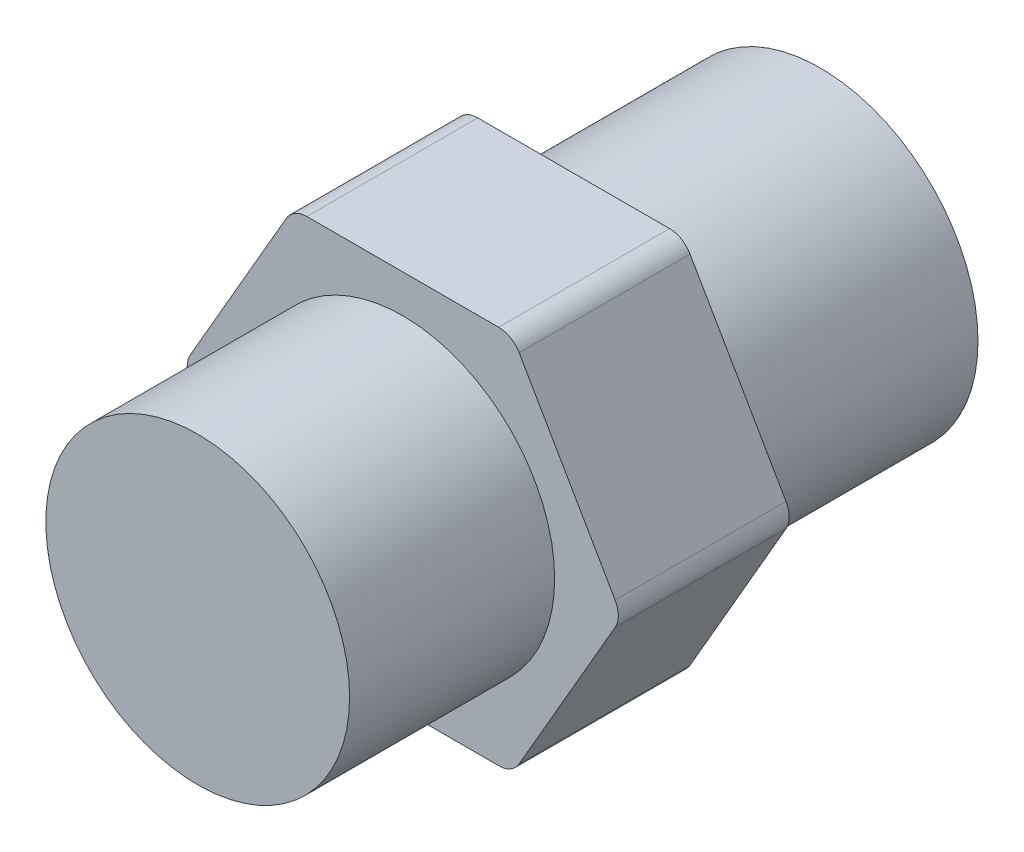
ISO-10303-21;
HEADER;
FILE_DESCRIPTION(('STEP AP214'),'2;1');
FILE_NAME('part.step','',(''),(''),'','','');
FILE_SCHEMA(('AUTOMOTIVE_DESIGN { 1 0 10303 214 1 1 1 1 }'));
ENDSEC;
DATA;
#1=APPLICATION_CONTEXT('core data for automotive mechanical design processes');
#2=APPLICATION_PROTOCOL_DEFINITION('international standard','automotive_design',2000,#1);
#3=PRODUCT_CONTEXT('',#1,'mechanical');
#4=PRODUCT('Part','Part','',(#3));
#5=PRODUCT_RELATED_PRODUCT_CATEGORY('part','',(#4));
#6=PRODUCT_DEFINITION_FORMATION('','',#4);
#7=PRODUCT_DEFINITION_CONTEXT('part definition',#1,'design');
#8=PRODUCT_DEFINITION('design','',#6,#7);
#9=PRODUCT_DEFINITION_SHAPE('','',#8);
#10=(LENGTH_UNIT() NAMED_UNIT(*) SI_UNIT(.MILLI.,.METRE.));
#11=(NAMED_UNIT(*) PLANE_ANGLE_UNIT() SI_UNIT($,.RADIAN.));
#12=(NAMED_UNIT(*) SI_UNIT($,.STERADIAN.) SOLID_ANGLE_UNIT());
#13=UNCERTAINTY_MEASURE_WITH_UNIT(LENGTH_MEASURE(1.E-05),#10,'distance_accuracy_value','');
#14=(GEOMETRIC_REPRESENTATION_CONTEXT(3) GLOBAL_UNCERTAINTY_ASSIGNED_CONTEXT((#13)) GLOBAL_UNIT_ASSIGNED_CONTEXT((#10,
#11,#12)) REPRESENTATION_CONTEXT('',''));
#15=CARTESIAN_POINT('',(0.,0.,0.));
#16=DIRECTION('',(0.,0.,1.));
#17=DIRECTION('',(1.,0.,0.));
#18=AXIS2_PLACEMENT_3D('',#15,#16,#17);
#19=CARTESIAN_POINT('',(-14.6646968374165,0.,11.43));
#20=DIRECTION('',(0.866025403784439,0.5,0.));
#21=DIRECTION('',(-0.5,0.866025403784439,0.));
#22=AXIS2_PLACEMENT_3D('',#19,#20,#21);
#23=PLANE('',#22);
#24=DIRECTION('',(0.5,-0.866025403784438,0.));
#25=VECTOR('',#24,1.);
#26=CARTESIAN_POINT('',(-14.6646968374165,0.,11.43));
#27=LINE('',#26,#25);
#28=CARTESIAN_POINT('',(-14.2064250612472,-0.793749999999992,11.43));
#29=VERTEX_POINT('',#28);
#30=CARTESIAN_POINT('',(-7.79062019487751,-11.90625,11.43));
#31=VERTEX_POINT('',#30);
#32=EDGE_CURVE('E229',#29,#31,#27,.T.);
#33=ORIENTED_EDGE('',*,*,#32,.F.);
#34=DIRECTION('',(0.,0.,-1.));
#35=VECTOR('',#34,1.);
#36=CARTESIAN_POINT('',(-14.2064250612472,-0.793749999999992,11.43));
#37=LINE('',#36,#35);
#38=CARTESIAN_POINT('',(-14.2064250612472,-0.793749999999992,0.));
#39=VERTEX_POINT('',#38);
#40=EDGE_CURVE('E214',#29,#39,#37,.T.);
#41=ORIENTED_EDGE('',*,*,#40,.T.);
#42=DIRECTION('',(0.5,-0.866025403784438,0.));
#43=VECTOR('',#42,1.);
#44=CARTESIAN_POINT('',(-14.6646968374165,0.,0.));
#45=LINE('',#44,#43);
#46=CARTESIAN_POINT('',(-7.79062019487751,-11.90625,0.));
#47=VERTEX_POINT('',#46);
#48=EDGE_CURVE('E226',#39,#47,#45,.T.);
#49=ORIENTED_EDGE('',*,*,#48,.T.);
#50=DIRECTION('',(0.,0.,-1.));
#51=VECTOR('',#50,1.);
#52=CARTESIAN_POINT('',(-7.79062019487751,-11.90625,11.43));
#53=LINE('',#52,#51);
#54=EDGE_CURVE('E231',#47,#31,#53,.F.);
#55=ORIENTED_EDGE('',*,*,#54,.T.);
#56=EDGE_LOOP('',(#33,#41,#49,#55));
#57=FACE_BOUND('',#56,.T.);
#58=DIRECTION('',(0.25,-0.433012701892219,0.866025403784439));
#59=VECTOR('',#58,1.);
#60=CARTESIAN_POINT('',(-10.1461371243875,-7.82637499999999,-0.984249999999998));
#61=LINE('',#60,#59);
#62=CARTESIAN_POINT('',(-9.37624054042317,-9.15987499999999,1.68275));
#63=VERTEX_POINT('',#62);
#64=CARTESIAN_POINT('',(-8.44136611703786,-10.779125,4.92125));
#65=VERTEX_POINT('',#64);
#66=EDGE_CURVE('E374',#63,#65,#61,.T.);
#67=ORIENTED_EDGE('',*,*,#66,.F.);
#68=CARTESIAN_POINT('',(-10.0636482046771,-7.96924999999999,2.4765));
#69=DIRECTION('',(0.866025403784439,0.5,0.));
#70=DIRECTION('',(-0.5,0.866025403784439,0.));
#71=AXIS2_PLACEMENT_3D('',#68,#69,#70);
#72=CIRCLE('',#71,1.5875);
#73=CARTESIAN_POINT('',(-10.0636482046771,-7.96924999999999,0.888999999999997));
#74=VERTEX_POINT('',#73);
#75=EDGE_CURVE('E333',#63,#74,#72,.T.);
#76=ORIENTED_EDGE('',*,*,#75,.T.);
#77=DIRECTION('',(0.5,-0.866025403784439,0.));
#78=VECTOR('',#77,1.);
#79=CARTESIAN_POINT('',(-10.9985226280624,-6.35,0.888999999999997));
#80=LINE('',#79,#78);
#81=CARTESIAN_POINT('',(-11.9333970514477,-4.73074999999999,0.888999999999997));
#82=VERTEX_POINT('',#81);
#83=EDGE_CURVE('E384',#82,#74,#80,.T.);
#84=ORIENTED_EDGE('',*,*,#83,.F.);
#85=CARTESIAN_POINT('',(-11.9333970514477,-4.73074999999999,2.4765));
#86=DIRECTION('',(0.866025403784439,0.5,0.));
#87=DIRECTION('',(-0.5,0.866025403784439,0.));
#88=AXIS2_PLACEMENT_3D('',#85,#86,#87);
#89=CIRCLE('',#88,1.5875);
#90=CARTESIAN_POINT('',(-12.6208047157016,-3.54012499999999,1.68275));
#91=VERTEX_POINT('',#90);
#92=EDGE_CURVE('E331',#82,#91,#89,.T.);
#93=ORIENTED_EDGE('',*,*,#92,.T.);
#94=DIRECTION('',(0.25,-0.433012701892219,-0.866025403784438));
#95=VECTOR('',#94,1.);
#96=CARTESIAN_POINT('',(-11.8509081317372,-4.87362499999999,-0.984250000000006));
#97=LINE('',#96,#95);
#98=CARTESIAN_POINT('',(-13.5556791390869,-1.92087499999999,4.92125));
#99=VERTEX_POINT('',#98);
#100=EDGE_CURVE('E381',#99,#91,#97,.T.);
#101=ORIENTED_EDGE('',*,*,#100,.F.);
#102=CARTESIAN_POINT('',(-12.868271474833,-3.11149999999999,5.715));
#103=DIRECTION('',(0.866025403784439,0.5,0.));
#104=DIRECTION('',(-0.5,0.866025403784439,0.));
#105=AXIS2_PLACEMENT_3D('',#102,#103,#104);
#106=CIRCLE('',#105,1.5875);
#107=CARTESIAN_POINT('',(-13.5556791390869,-1.92087499999999,6.50875));
#108=VERTEX_POINT('',#107);
#109=EDGE_CURVE('E13',#99,#108,#106,.T.);
#110=ORIENTED_EDGE('',*,*,#109,.T.);
#111=DIRECTION('',(-0.25,0.433012701892219,-0.866025403784439));
#112=VECTOR('',#111,1.);
#113=CARTESIAN_POINT('',(-14.3255757230512,-0.587374999999987,3.84175000000001));
#114=LINE('',#113,#112);
#115=CARTESIAN_POINT('',(-12.6208047157016,-3.54012499999999,9.74725));
#116=VERTEX_POINT('',#115);
#117=EDGE_CURVE('E342',#116,#108,#114,.T.);
#118=ORIENTED_EDGE('',*,*,#117,.F.);
#119=CARTESIAN_POINT('',(-11.9333970514477,-4.73074999999999,8.9535));
#120=DIRECTION('',(0.866025403784439,0.5,0.));
#121=DIRECTION('',(-0.5,0.866025403784439,0.));
#122=AXIS2_PLACEMENT_3D('',#119,#120,#121);
#123=CIRCLE('',#122,1.5875);
#124=CARTESIAN_POINT('',(-11.9333970514477,-4.73074999999999,10.541));
#125=VERTEX_POINT('',#124);
#126=EDGE_CURVE('E58',#116,#125,#123,.T.);
#127=ORIENTED_EDGE('',*,*,#126,.T.);
#128=DIRECTION('',(-0.5,0.866025403784439,0.));
#129=VECTOR('',#128,1.);
#130=CARTESIAN_POINT('',(-10.9985226280624,-6.35,10.541));
#131=LINE('',#130,#129);
#132=CARTESIAN_POINT('',(-10.0636482046771,-7.96924999999999,10.541));
#133=VERTEX_POINT('',#132);
#134=EDGE_CURVE('E341',#133,#125,#131,.T.);
#135=ORIENTED_EDGE('',*,*,#134,.F.);
#136=CARTESIAN_POINT('',(-10.0636482046771,-7.96924999999999,8.9535));
#137=DIRECTION('',(0.866025403784439,0.5,0.));
#138=DIRECTION('',(-0.5,0.866025403784439,0.));
#139=AXIS2_PLACEMENT_3D('',#136,#137,#138);
#140=CIRCLE('',#139,1.5875);
#141=CARTESIAN_POINT('',(-9.37624054042317,-9.15987499999999,9.74725));
#142=VERTEX_POINT('',#141);
#143=EDGE_CURVE('E337',#133,#142,#140,.T.);
#144=ORIENTED_EDGE('',*,*,#143,.T.);
#145=DIRECTION('',(-0.25,0.433012701892219,0.866025403784439));
#146=VECTOR('',#145,1.);
#147=CARTESIAN_POINT('',(-7.6714695330735,-12.112625,3.84175));
#148=LINE('',#147,#146);
#149=CARTESIAN_POINT('',(-8.44136611703787,-10.779125,6.50875));
#150=VERTEX_POINT('',#149);
#151=EDGE_CURVE('E348',#150,#142,#148,.T.);
#152=ORIENTED_EDGE('',*,*,#151,.F.);
#153=CARTESIAN_POINT('',(-9.12877378129177,-9.58849999999999,5.715));
#154=DIRECTION('',(0.866025403784439,0.5,0.));
#155=DIRECTION('',(-0.5,0.866025403784439,0.));
#156=AXIS2_PLACEMENT_3D('',#153,#154,#155);
#157=CIRCLE('',#156,1.5875);
#158=EDGE_CURVE('E335',#150,#65,#157,.T.);
#159=ORIENTED_EDGE('',*,*,#158,.T.);
#160=EDGE_LOOP('',(#67,#76,#84,#93,#101,#110,#118,#127,#135,#144,#152,#159));
#161=FACE_BOUND('',#160,.T.);
#162=ADVANCED_FACE('F50',(#57,#161),#23,.F.);
#163=CARTESIAN_POINT('',(7.33234841870828,-12.7,11.43));
#164=DIRECTION('',(-0.866025403784439,0.5,0.));
#165=DIRECTION('',(-0.5,-0.866025403784439,0.));
#166=AXIS2_PLACEMENT_3D('',#163,#164,#165);
#167=PLANE('',#166);
#168=DIRECTION('',(0.5,0.866025403784439,0.));
#169=VECTOR('',#168,1.);
#170=CARTESIAN_POINT('',(7.33234841870828,-12.7,0.));
#171=LINE('',#170,#169);
#172=CARTESIAN_POINT('',(7.79062019487755,-11.90625,0.));
#173=VERTEX_POINT('',#172);
#174=CARTESIAN_POINT('',(14.2064250612472,-0.793750000000037,0.));
#175=VERTEX_POINT('',#174);
#176=EDGE_CURVE('E373',#173,#175,#171,.T.);
#177=ORIENTED_EDGE('',*,*,#176,.T.);
#178=DIRECTION('',(0.,0.,-1.));
#179=VECTOR('',#178,1.);
#180=CARTESIAN_POINT('',(14.2064250612472,-0.793750000000032,11.43));
#181=LINE('',#180,#179);
#182=CARTESIAN_POINT('',(14.2064250612472,-0.793750000000037,11.43));
#183=VERTEX_POINT('',#182);
#184=EDGE_CURVE('E283',#175,#183,#181,.F.);
#185=ORIENTED_EDGE('',*,*,#184,.T.);
#186=DIRECTION('',(0.5,0.866025403784439,0.));
#187=VECTOR('',#186,1.);
#188=CARTESIAN_POINT('',(7.33234841870828,-12.7,11.43));
#189=LINE('',#188,#187);
#190=CARTESIAN_POINT('',(7.79062019487755,-11.90625,11.43));
#191=VERTEX_POINT('',#190);
#192=EDGE_CURVE('E240',#191,#183,#189,.T.);
#193=ORIENTED_EDGE('',*,*,#192,.F.);
#194=DIRECTION('',(0.,0.,-1.));
#195=VECTOR('',#194,1.);
#196=CARTESIAN_POINT('',(7.79062019487755,-11.90625,11.43));
#197=LINE('',#196,#195);
#198=EDGE_CURVE('E280',#191,#173,#197,.T.);
#199=ORIENTED_EDGE('',*,*,#198,.T.);
#200=EDGE_LOOP('',(#177,#185,#193,#199));
#201=FACE_BOUND('',#200,.T.);
#202=ADVANCED_FACE('F437',(#201),#167,.F.);
#203=CARTESIAN_POINT('',(14.6646968374165,0.,11.43));
#204=DIRECTION('',(-0.866025403784439,-0.5,0.));
#205=DIRECTION('',(0.5,-0.866025403784439,0.));
#206=AXIS2_PLACEMENT_3D('',#203,#204,#205);
#207=PLANE('',#206);
#208=DIRECTION('',(-0.5,0.866025403784439,0.));
#209=VECTOR('',#208,1.);
#210=CARTESIAN_POINT('',(14.6646968374165,0.,0.));
#211=LINE('',#210,#209);
#212=CARTESIAN_POINT('',(14.2064250612472,0.793749999999965,0.));
#213=VERTEX_POINT('',#212);
#214=CARTESIAN_POINT('',(7.79062019487749,11.90625,0.));
#215=VERTEX_POINT('',#214);
#216=EDGE_CURVE('E406',#213,#215,#211,.T.);
#217=ORIENTED_EDGE('',*,*,#216,.T.);
#218=DIRECTION('',(0.,0.,-1.));
#219=VECTOR('',#218,1.);
#220=CARTESIAN_POINT('',(7.79062019487749,11.90625,11.43));
#221=LINE('',#220,#219);
#222=CARTESIAN_POINT('',(7.79062019487749,11.90625,11.43));
#223=VERTEX_POINT('',#222);
#224=EDGE_CURVE('E278',#215,#223,#221,.F.);
#225=ORIENTED_EDGE('',*,*,#224,.T.);
#226=DIRECTION('',(-0.5,0.866025403784439,0.));
#227=VECTOR('',#226,1.);
#228=CARTESIAN_POINT('',(14.6646968374165,0.,11.43));
#229=LINE('',#228,#227);
#230=CARTESIAN_POINT('',(14.2064250612472,0.793749999999965,11.43));
#231=VERTEX_POINT('',#230);
#232=EDGE_CURVE('E390',#231,#223,#229,.T.);
#233=ORIENTED_EDGE('',*,*,#232,.F.);
#234=DIRECTION('',(0.,0.,-1.));
#235=VECTOR('',#234,1.);
#236=CARTESIAN_POINT('',(14.2064250612472,0.793749999999965,11.43));
#237=LINE('',#236,#235);
#238=EDGE_CURVE('E275',#231,#213,#237,.T.);
#239=ORIENTED_EDGE('',*,*,#238,.T.);
#240=EDGE_LOOP('',(#217,#225,#233,#239));
#241=FACE_BOUND('',#240,.T.);
#242=ADVANCED_FACE('F433',(#241),#207,.F.);
#243=CARTESIAN_POINT('',(7.33234841870823,12.7,11.43));
#244=DIRECTION('',(0.,-1.,0.));
#245=DIRECTION('',(0.,0.,-1.));
#246=AXIS2_PLACEMENT_3D('',#243,#244,#245);
#247=PLANE('',#246);
#248=DIRECTION('',(-1.,0.,0.));
#249=VECTOR('',#248,1.);
#250=CARTESIAN_POINT('',(7.33234841870823,12.7,0.));
#251=LINE('',#250,#249);
#252=CARTESIAN_POINT('',(6.4158048663697,12.7,0.));
#253=VERTEX_POINT('',#252);
#254=CARTESIAN_POINT('',(-6.41580486636972,12.7,0.));
#255=VERTEX_POINT('',#254);
#256=EDGE_CURVE('E242',#253,#255,#251,.T.);
#257=ORIENTED_EDGE('',*,*,#256,.T.);
#258=DIRECTION('',(0.,0.,-1.));
#259=VECTOR('',#258,1.);
#260=CARTESIAN_POINT('',(-6.41580486636972,12.7,11.43));
#261=LINE('',#260,#259);
#262=CARTESIAN_POINT('',(-6.41580486636972,12.7,11.43));
#263=VERTEX_POINT('',#262);
#264=EDGE_CURVE('E273',#255,#263,#261,.F.);
#265=ORIENTED_EDGE('',*,*,#264,.T.);
#266=DIRECTION('',(-1.,0.,0.));
#267=VECTOR('',#266,1.);
#268=CARTESIAN_POINT('',(7.33234841870823,12.7,11.43));
#269=LINE('',#268,#267);
#270=CARTESIAN_POINT('',(6.4158048663697,12.7,11.43));
#271=VERTEX_POINT('',#270);
#272=EDGE_CURVE('E393',#271,#263,#269,.T.);
#273=ORIENTED_EDGE('',*,*,#272,.F.);
#274=DIRECTION('',(0.,0.,-1.));
#275=VECTOR('',#274,1.);
#276=CARTESIAN_POINT('',(6.4158048663697,12.7,11.43));
#277=LINE('',#276,#275);
#278=EDGE_CURVE('E270',#271,#253,#277,.T.);
#279=ORIENTED_EDGE('',*,*,#278,.T.);
#280=EDGE_LOOP('',(#257,#265,#273,#279));
#281=FACE_BOUND('',#280,.T.);
#282=ADVANCED_FACE('F412',(#281),#247,.F.);
#283=CARTESIAN_POINT('',(-7.33234841870825,12.7,11.43));
#284=DIRECTION('',(0.866025403784439,-0.5,0.));
#285=DIRECTION('',(0.5,0.866025403784439,0.));
#286=AXIS2_PLACEMENT_3D('',#283,#284,#285);
#287=PLANE('',#286);
#288=DIRECTION('',(-0.5,-0.866025403784438,0.));
#289=VECTOR('',#288,1.);
#290=CARTESIAN_POINT('',(-7.33234841870825,12.7,0.));
#291=LINE('',#290,#289);
#292=CARTESIAN_POINT('',(-7.79062019487751,11.90625,0.));
#293=VERTEX_POINT('',#292);
#294=CARTESIAN_POINT('',(-14.2064250612472,0.793750000000012,0.));
#295=VERTEX_POINT('',#294);
#296=EDGE_CURVE('E237',#293,#295,#291,.T.);
#297=ORIENTED_EDGE('',*,*,#296,.T.);
#298=DIRECTION('',(0.,0.,-1.));
#299=VECTOR('',#298,1.);
#300=CARTESIAN_POINT('',(-14.2064250612472,0.793750000000008,11.43));
#301=LINE('',#300,#299);
#302=CARTESIAN_POINT('',(-14.2064250612472,0.793750000000012,11.43));
#303=VERTEX_POINT('',#302);
#304=EDGE_CURVE('E215',#295,#303,#301,.F.);
#305=ORIENTED_EDGE('',*,*,#304,.T.);
#306=DIRECTION('',(-0.5,-0.866025403784438,0.));
#307=VECTOR('',#306,1.);
#308=CARTESIAN_POINT('',(-7.33234841870825,12.7,11.43));
#309=LINE('',#308,#307);
#310=CARTESIAN_POINT('',(-7.79062019487751,11.90625,11.43));
#311=VERTEX_POINT('',#310);
#312=EDGE_CURVE('E396',#311,#303,#309,.T.);
#313=ORIENTED_EDGE('',*,*,#312,.F.);
#314=DIRECTION('',(0.,0.,-1.));
#315=VECTOR('',#314,1.);
#316=CARTESIAN_POINT('',(-7.79062019487751,11.90625,11.43));
#317=LINE('',#316,#315);
#318=EDGE_CURVE('E220',#311,#293,#317,.T.);
#319=ORIENTED_EDGE('',*,*,#318,.T.);
#320=EDGE_LOOP('',(#297,#305,#313,#319));
#321=FACE_BOUND('',#320,.T.);
#322=ADVANCED_FACE('F423',(#321),#287,.F.);
#323=CARTESIAN_POINT('',(-7.33234841870825,-12.7,11.43));
#324=DIRECTION('',(0.,1.,0.));
#325=DIRECTION('',(0.,0.,1.));
#326=AXIS2_PLACEMENT_3D('',#323,#324,#325);
#327=PLANE('',#326);
#328=DIRECTION('',(1.,0.,0.));
#329=VECTOR('',#328,1.);
#330=CARTESIAN_POINT('',(-7.33234841870825,-12.7,11.43));
#331=LINE('',#330,#329);
#332=CARTESIAN_POINT('',(-6.41580486636972,-12.7,11.43));
#333=VERTEX_POINT('',#332);
#334=CARTESIAN_POINT('',(6.41580486636975,-12.7,11.43));
#335=VERTEX_POINT('',#334);
#336=EDGE_CURVE('E400',#333,#335,#331,.T.);
#337=ORIENTED_EDGE('',*,*,#336,.F.);
#338=DIRECTION('',(0.,0.,-1.));
#339=VECTOR('',#338,1.);
#340=CARTESIAN_POINT('',(-6.41580486636972,-12.7,11.43));
#341=LINE('',#340,#339);
#342=CARTESIAN_POINT('',(-6.41580486636972,-12.7,0.));
#343=VERTEX_POINT('',#342);
#344=EDGE_CURVE('E287',#333,#343,#341,.T.);
#345=ORIENTED_EDGE('',*,*,#344,.T.);
#346=DIRECTION('',(1.,0.,0.));
#347=VECTOR('',#346,1.);
#348=CARTESIAN_POINT('',(-7.33234841870825,-12.7,0.));
#349=LINE('',#348,#347);
#350=CARTESIAN_POINT('',(6.41580486636975,-12.7,0.));
#351=VERTEX_POINT('',#350);
#352=EDGE_CURVE('E236',#343,#351,#349,.T.);
#353=ORIENTED_EDGE('',*,*,#352,.T.);
#354=DIRECTION('',(0.,0.,-1.));
#355=VECTOR('',#354,1.);
#356=CARTESIAN_POINT('',(6.41580486636975,-12.7,11.43));
#357=LINE('',#356,#355);
#358=EDGE_CURVE('E285',#351,#335,#357,.F.);
#359=ORIENTED_EDGE('',*,*,#358,.T.);
#360=EDGE_LOOP('',(#337,#345,#353,#359));
#361=FACE_BOUND('',#360,.T.);
#362=ADVANCED_FACE('F425',(#361),#327,.F.);
#363=CARTESIAN_POINT('',(0.,0.,11.43));
#364=DIRECTION('',(0.,0.,1.));
#365=DIRECTION('',(1.,0.,0.));
#366=AXIS2_PLACEMENT_3D('',#363,#364,#365);
#367=PLANE('',#366);
#368=CARTESIAN_POINT('',(0.,0.,11.43));
#369=DIRECTION('',(0.,0.,1.));
#370=DIRECTION('',(1.,0.,0.));
#371=AXIS2_PLACEMENT_3D('',#368,#369,#370);
#372=CIRCLE('',#371,10.16);
#373=CARTESIAN_POINT('',(10.16,0.,11.43));
#374=VERTEX_POINT('',#373);
#375=EDGE_CURVE('E403',#374,#374,#372,.T.);
#376=ORIENTED_EDGE('',*,*,#375,.F.);
#377=EDGE_LOOP('',(#376));
#378=FACE_BOUND('',#377,.T.);
#379=ORIENTED_EDGE('',*,*,#312,.T.);
#380=CARTESIAN_POINT('',(-12.8316097327394,0.,11.43));
#381=DIRECTION('',(0.,0.,1.));
#382=DIRECTION('',(1.,0.,0.));
#383=AXIS2_PLACEMENT_3D('',#380,#381,#382);
#384=CIRCLE('',#383,1.5875);
#385=EDGE_CURVE('E268',#303,#29,#384,.T.);
#386=ORIENTED_EDGE('',*,*,#385,.T.);
#387=ORIENTED_EDGE('',*,*,#32,.T.);
#388=CARTESIAN_POINT('',(-6.41580486636972,-11.1125,11.43));
#389=DIRECTION('',(0.,0.,1.));
#390=DIRECTION('',(1.,0.,0.));
#391=AXIS2_PLACEMENT_3D('',#388,#389,#390);
#392=CIRCLE('',#391,1.5875);
#393=EDGE_CURVE('E260',#31,#333,#392,.T.);
#394=ORIENTED_EDGE('',*,*,#393,.T.);
#395=ORIENTED_EDGE('',*,*,#336,.T.);
#396=CARTESIAN_POINT('',(6.41580486636975,-11.1125,11.43));
#397=DIRECTION('',(0.,0.,1.));
#398=DIRECTION('',(1.,0.,0.));
#399=AXIS2_PLACEMENT_3D('',#396,#397,#398);
#400=CIRCLE('',#399,1.5875);
#401=EDGE_CURVE('E258',#335,#191,#400,.T.);
#402=ORIENTED_EDGE('',*,*,#401,.T.);
#403=ORIENTED_EDGE('',*,*,#192,.T.);
#404=CARTESIAN_POINT('',(12.8316097327394,0.,11.43));
#405=DIRECTION('',(0.,0.,1.));
#406=DIRECTION('',(1.,0.,0.));
#407=AXIS2_PLACEMENT_3D('',#404,#405,#406);
#408=CIRCLE('',#407,1.5875);
#409=EDGE_CURVE('E262',#183,#231,#408,.T.);
#410=ORIENTED_EDGE('',*,*,#409,.T.);
#411=ORIENTED_EDGE('',*,*,#232,.T.);
#412=CARTESIAN_POINT('',(6.4158048663697,11.1125,11.43));
#413=DIRECTION('',(0.,0.,1.));
#414=DIRECTION('',(1.,0.,0.));
#415=AXIS2_PLACEMENT_3D('',#412,#413,#414);
#416=CIRCLE('',#415,1.5875);
#417=EDGE_CURVE('E264',#223,#271,#416,.T.);
#418=ORIENTED_EDGE('',*,*,#417,.T.);
#419=ORIENTED_EDGE('',*,*,#272,.T.);
#420=CARTESIAN_POINT('',(-6.41580486636972,11.1125,11.43));
#421=DIRECTION('',(0.,0.,1.));
#422=DIRECTION('',(1.,0.,0.));
#423=AXIS2_PLACEMENT_3D('',#420,#421,#422);
#424=CIRCLE('',#423,1.5875);
#425=EDGE_CURVE('E266',#263,#311,#424,.T.);
#426=ORIENTED_EDGE('',*,*,#425,.T.);
#427=EDGE_LOOP('',(#379,#386,#387,#394,#395,#402,#403,#410,#411,#418,#419,#426));
#428=FACE_BOUND('',#427,.T.);
#429=ADVANCED_FACE('F421',(#378,#428),#367,.T.);
#430=CARTESIAN_POINT('',(0.,0.,0.));
#431=DIRECTION('',(0.,0.,1.));
#432=DIRECTION('',(1.,0.,0.));
#433=AXIS2_PLACEMENT_3D('',#430,#431,#432);
#434=PLANE('',#433);
#435=CARTESIAN_POINT('',(0.,0.,0.));
#436=DIRECTION('',(0.,0.,-1.));
#437=DIRECTION('',(-1.,0.,0.));
#438=AXIS2_PLACEMENT_3D('',#435,#436,#437);
#439=CIRCLE('',#438,10.541);
#440=CARTESIAN_POINT('',(-10.541,0.,0.));
#441=VERTEX_POINT('',#440);
#442=EDGE_CURVE('E246',#441,#441,#439,.T.);
#443=ORIENTED_EDGE('',*,*,#442,.F.);
#444=EDGE_LOOP('',(#443));
#445=FACE_BOUND('',#444,.T.);
#446=ORIENTED_EDGE('',*,*,#48,.F.);
#447=CARTESIAN_POINT('',(-12.8316097327394,0.,0.));
#448=DIRECTION('',(0.,0.,1.));
#449=DIRECTION('',(1.,0.,0.));
#450=AXIS2_PLACEMENT_3D('',#447,#448,#449);
#451=CIRCLE('',#450,1.5875);
#452=EDGE_CURVE('E210',#39,#295,#451,.F.);
#453=ORIENTED_EDGE('',*,*,#452,.T.);
#454=ORIENTED_EDGE('',*,*,#296,.F.);
#455=CARTESIAN_POINT('',(-6.41580486636972,11.1125,0.));
#456=DIRECTION('',(0.,0.,1.));
#457=DIRECTION('',(1.,0.,0.));
#458=AXIS2_PLACEMENT_3D('',#455,#456,#457);
#459=CIRCLE('',#458,1.5875);
#460=EDGE_CURVE('E221',#293,#255,#459,.F.);
#461=ORIENTED_EDGE('',*,*,#460,.T.);
#462=ORIENTED_EDGE('',*,*,#256,.F.);
#463=CARTESIAN_POINT('',(6.4158048663697,11.1125,0.));
#464=DIRECTION('',(0.,0.,1.));
#465=DIRECTION('',(1.,0.,0.));
#466=AXIS2_PLACEMENT_3D('',#463,#464,#465);
#467=CIRCLE('',#466,1.5875);
#468=EDGE_CURVE('E252',#253,#215,#467,.F.);
#469=ORIENTED_EDGE('',*,*,#468,.T.);
#470=ORIENTED_EDGE('',*,*,#216,.F.);
#471=CARTESIAN_POINT('',(12.8316097327394,0.,0.));
#472=DIRECTION('',(0.,0.,1.));
#473=DIRECTION('',(1.,0.,0.));
#474=AXIS2_PLACEMENT_3D('',#471,#472,#473);
#475=CIRCLE('',#474,1.5875);
#476=EDGE_CURVE('E250',#213,#175,#475,.F.);
#477=ORIENTED_EDGE('',*,*,#476,.T.);
#478=ORIENTED_EDGE('',*,*,#176,.F.);
#479=CARTESIAN_POINT('',(6.41580486636975,-11.1125,0.));
#480=DIRECTION('',(0.,0.,1.));
#481=DIRECTION('',(1.,0.,0.));
#482=AXIS2_PLACEMENT_3D('',#479,#480,#481);
#483=CIRCLE('',#482,1.5875);
#484=EDGE_CURVE('E230',#173,#351,#483,.F.);
#485=ORIENTED_EDGE('',*,*,#484,.T.);
#486=ORIENTED_EDGE('',*,*,#352,.F.);
#487=CARTESIAN_POINT('',(-6.41580486636972,-11.1125,0.));
#488=DIRECTION('',(0.,0.,1.));
#489=DIRECTION('',(1.,0.,0.));
#490=AXIS2_PLACEMENT_3D('',#487,#488,#489);
#491=CIRCLE('',#490,1.5875);
#492=EDGE_CURVE('E235',#343,#47,#491,.F.);
#493=ORIENTED_EDGE('',*,*,#492,.T.);
#494=EDGE_LOOP('',(#446,#453,#454,#461,#462,#469,#470,#477,#478,#485,#486,#493));
#495=FACE_BOUND('',#494,.T.);
#496=ADVANCED_FACE('F233',(#445,#495),#434,.F.);
#497=CARTESIAN_POINT('',(-15.6453984384187,-11.001375,-0.984249999999998));
#498=DIRECTION('',(-0.433012701892219,0.75,0.5));
#499=DIRECTION('',(0.,-0.554700196225229,0.832050294337844));
#500=AXIS2_PLACEMENT_3D('',#497,#498,#499);
#501=PLANE('',#500);
#502=DIRECTION('',(0.25,-0.433012701892219,0.866025403784439));
#503=VECTOR('',#502,1.);
#504=CARTESIAN_POINT('',(-15.6453984384187,-11.001375,-0.984249999999998));
#505=LINE('',#504,#503);
#506=CARTESIAN_POINT('',(-14.8755018544544,-12.334875,1.68275));
#507=VERTEX_POINT('',#506);
#508=CARTESIAN_POINT('',(-13.940627431069,-13.954125,4.92125));
#509=VERTEX_POINT('',#508);
#510=EDGE_CURVE('E387',#507,#509,#505,.T.);
#511=ORIENTED_EDGE('',*,*,#510,.F.);
#512=DIRECTION('',(0.866025403784438,0.5,0.));
#513=VECTOR('',#512,1.);
#514=CARTESIAN_POINT('',(-14.8755018544544,-12.334875,1.68275));
#515=LINE('',#514,#513);
#516=EDGE_CURVE('E314',#507,#63,#515,.T.);
#517=ORIENTED_EDGE('',*,*,#516,.T.);
#518=ORIENTED_EDGE('',*,*,#66,.T.);
#519=DIRECTION('',(0.866025403784438,0.5,0.));
#520=VECTOR('',#519,1.);
#521=CARTESIAN_POINT('',(-13.940627431069,-13.954125,4.92125));
#522=LINE('',#521,#520);
#523=EDGE_CURVE('E312',#65,#509,#522,.F.);
#524=ORIENTED_EDGE('',*,*,#523,.T.);
#525=EDGE_LOOP('',(#511,#517,#518,#524));
#526=FACE_BOUND('',#525,.T.);
#527=ADVANCED_FACE('F446',(#526),#501,.F.);
#528=CARTESIAN_POINT('',(-13.1707308471047,-15.287625,3.84175));
#529=DIRECTION('',(-0.433012701892219,0.75,-0.5));
#530=DIRECTION('',(0.,0.554700196225229,0.832050294337844));
#531=AXIS2_PLACEMENT_3D('',#528,#529,#530);
#532=PLANE('',#531);
#533=DIRECTION('',(-0.25,0.433012701892219,0.866025403784439));
#534=VECTOR('',#533,1.);
#535=CARTESIAN_POINT('',(-13.1707308471047,-15.287625,3.84175));
#536=LINE('',#535,#534);
#537=CARTESIAN_POINT('',(-13.9406274310691,-13.954125,6.50875));
#538=VERTEX_POINT('',#537);
#539=CARTESIAN_POINT('',(-14.8755018544544,-12.334875,9.74725));
#540=VERTEX_POINT('',#539);
#541=EDGE_CURVE('E367',#538,#540,#536,.T.);
#542=ORIENTED_EDGE('',*,*,#541,.F.);
#543=DIRECTION('',(0.866025403784439,0.5,0.));
#544=VECTOR('',#543,1.);
#545=CARTESIAN_POINT('',(-13.9406274310691,-13.954125,6.50875));
#546=LINE('',#545,#544);
#547=EDGE_CURVE('E319',#538,#150,#546,.T.);
#548=ORIENTED_EDGE('',*,*,#547,.T.);
#549=ORIENTED_EDGE('',*,*,#151,.T.);
#550=DIRECTION('',(0.866025403784439,0.5,0.));
#551=VECTOR('',#550,1.);
#552=CARTESIAN_POINT('',(-14.8755018544544,-12.334875,9.74725));
#553=LINE('',#552,#551);
#554=EDGE_CURVE('E317',#142,#540,#553,.F.);
#555=ORIENTED_EDGE('',*,*,#554,.T.);
#556=EDGE_LOOP('',(#542,#548,#549,#555));
#557=FACE_BOUND('',#556,.T.);
#558=ADVANCED_FACE('F453',(#557),#532,.F.);
#559=CARTESIAN_POINT('',(-16.4977839420936,-9.525,10.541));
#560=DIRECTION('',(0.,0.,-1.));
#561=DIRECTION('',(-1.,0.,0.));
#562=AXIS2_PLACEMENT_3D('',#559,#560,#561);
#563=PLANE('',#562);
#564=DIRECTION('',(-0.5,0.866025403784439,0.));
#565=VECTOR('',#564,1.);
#566=CARTESIAN_POINT('',(-16.4977839420936,-9.525,10.541));
#567=LINE('',#566,#565);
#568=CARTESIAN_POINT('',(-15.5629095187083,-11.14425,10.541));
#569=VERTEX_POINT('',#568);
#570=CARTESIAN_POINT('',(-17.4326583654789,-7.90574999999999,10.541));
#571=VERTEX_POINT('',#570);
#572=EDGE_CURVE('E359',#569,#571,#567,.T.);
#573=ORIENTED_EDGE('',*,*,#572,.F.);
#574=DIRECTION('',(0.866025403784439,0.5,0.));
#575=VECTOR('',#574,1.);
#576=CARTESIAN_POINT('',(-15.5629095187083,-11.14425,10.541));
#577=LINE('',#576,#575);
#578=EDGE_CURVE('E324',#569,#133,#577,.T.);
#579=ORIENTED_EDGE('',*,*,#578,.T.);
#580=ORIENTED_EDGE('',*,*,#134,.T.);
#581=DIRECTION('',(0.866025403784439,0.5,0.));
#582=VECTOR('',#581,1.);
#583=CARTESIAN_POINT('',(-17.4326583654789,-7.90574999999999,10.541));
#584=LINE('',#583,#582);
#585=EDGE_CURVE('E322',#125,#571,#584,.F.);
#586=ORIENTED_EDGE('',*,*,#585,.T.);
#587=EDGE_LOOP('',(#573,#579,#580,#586));
#588=FACE_BOUND('',#587,.T.);
#589=ADVANCED_FACE('F345',(#588),#563,.F.);
#590=CARTESIAN_POINT('',(-19.8248370370824,-3.76237499999999,3.84175000000001));
#591=DIRECTION('',(0.433012701892219,-0.75,-0.5));
#592=DIRECTION('',(0.,0.554700196225229,-0.832050294337844));
#593=AXIS2_PLACEMENT_3D('',#590,#591,#592);
#594=PLANE('',#593);
#595=DIRECTION('',(-0.25,0.433012701892219,-0.866025403784439));
#596=VECTOR('',#595,1.);
#597=CARTESIAN_POINT('',(-19.8248370370824,-3.76237499999999,3.84175000000001));
#598=LINE('',#597,#596);
#599=CARTESIAN_POINT('',(-18.1200660297328,-6.71512499999999,9.74725));
#600=VERTEX_POINT('',#599);
#601=CARTESIAN_POINT('',(-19.0549404531181,-5.09587499999999,6.50875));
#602=VERTEX_POINT('',#601);
#603=EDGE_CURVE('E357',#600,#602,#598,.T.);
#604=ORIENTED_EDGE('',*,*,#603,.F.);
#605=DIRECTION('',(0.866025403784438,0.5,0.));
#606=VECTOR('',#605,1.);
#607=CARTESIAN_POINT('',(-18.1200660297328,-6.71512499999999,9.74725));
#608=LINE('',#607,#606);
#609=EDGE_CURVE('E329',#600,#116,#608,.T.);
#610=ORIENTED_EDGE('',*,*,#609,.T.);
#611=ORIENTED_EDGE('',*,*,#117,.T.);
#612=DIRECTION('',(0.866025403784438,0.5,0.));
#613=VECTOR('',#612,1.);
#614=CARTESIAN_POINT('',(-19.0549404531181,-5.09587499999999,6.50875));
#615=LINE('',#614,#613);
#616=EDGE_CURVE('E327',#108,#602,#615,.F.);
#617=ORIENTED_EDGE('',*,*,#616,.T.);
#618=EDGE_LOOP('',(#604,#610,#611,#617));
#619=FACE_BOUND('',#618,.T.);
#620=ADVANCED_FACE('F361',(#619),#594,.F.);
#621=CARTESIAN_POINT('',(-17.3501694457684,-8.04862499999999,-0.984250000000006));
#622=DIRECTION('',(0.433012701892219,-0.75,0.5));
#623=DIRECTION('',(0.,-0.554700196225229,-0.832050294337844));
#624=AXIS2_PLACEMENT_3D('',#621,#622,#623);
#625=PLANE('',#624);
#626=ORIENTED_EDGE('',*,*,#100,.T.);
#627=DIRECTION('',(0.866025403784438,0.5,0.));
#628=VECTOR('',#627,1.);
#629=CARTESIAN_POINT('',(-18.1200660297328,-6.71512499999999,1.68275));
#630=LINE('',#629,#628);
#631=CARTESIAN_POINT('',(-18.1200660297328,-6.71512499999999,1.68275));
#632=VERTEX_POINT('',#631);
#633=EDGE_CURVE('E298',#91,#632,#630,.F.);
#634=ORIENTED_EDGE('',*,*,#633,.T.);
#635=DIRECTION('',(0.25,-0.433012701892219,-0.866025403784438));
#636=VECTOR('',#635,1.);
#637=CARTESIAN_POINT('',(-17.3501694457684,-8.04862499999999,-0.984250000000006));
#638=LINE('',#637,#636);
#639=CARTESIAN_POINT('',(-19.0549404531181,-5.09587499999999,4.92125));
#640=VERTEX_POINT('',#639);
#641=EDGE_CURVE('E363',#640,#632,#638,.T.);
#642=ORIENTED_EDGE('',*,*,#641,.F.);
#643=DIRECTION('',(0.866025403784438,0.5,0.));
#644=VECTOR('',#643,1.);
#645=CARTESIAN_POINT('',(-19.0549404531181,-5.09587499999999,4.92125));
#646=LINE('',#645,#644);
#647=EDGE_CURVE('E295',#640,#99,#646,.T.);
#648=ORIENTED_EDGE('',*,*,#647,.T.);
#649=EDGE_LOOP('',(#626,#634,#642,#648));
#650=FACE_BOUND('',#649,.T.);
#651=ADVANCED_FACE('F462',(#650),#625,.F.);
#652=CARTESIAN_POINT('',(-16.4977839420936,-9.525,0.888999999999997));
#653=DIRECTION('',(0.,0.,1.));
#654=DIRECTION('',(0.,-1.,0.));
#655=AXIS2_PLACEMENT_3D('',#652,#653,#654);
#656=PLANE('',#655);
#657=DIRECTION('',(0.5,-0.866025403784439,0.));
#658=VECTOR('',#657,1.);
#659=CARTESIAN_POINT('',(-16.4977839420936,-9.525,0.888999999999997));
#660=LINE('',#659,#658);
#661=CARTESIAN_POINT('',(-17.4326583654789,-7.90574999999999,0.888999999999997));
#662=VERTEX_POINT('',#661);
#663=CARTESIAN_POINT('',(-15.5629095187083,-11.14425,0.888999999999997));
#664=VERTEX_POINT('',#663);
#665=EDGE_CURVE('E365',#662,#664,#660,.T.);
#666=ORIENTED_EDGE('',*,*,#665,.F.);
#667=DIRECTION('',(0.866025403784439,0.5,0.));
#668=VECTOR('',#667,1.);
#669=CARTESIAN_POINT('',(-17.4326583654789,-7.90574999999999,0.888999999999997));
#670=LINE('',#669,#668);
#671=EDGE_CURVE('E292',#662,#82,#670,.T.);
#672=ORIENTED_EDGE('',*,*,#671,.T.);
#673=ORIENTED_EDGE('',*,*,#83,.T.);
#674=DIRECTION('',(0.866025403784439,0.5,0.));
#675=VECTOR('',#674,1.);
#676=CARTESIAN_POINT('',(-15.5629095187083,-11.14425,0.888999999999997));
#677=LINE('',#676,#675);
#678=EDGE_CURVE('E290',#74,#664,#677,.F.);
#679=ORIENTED_EDGE('',*,*,#678,.T.);
#680=EDGE_LOOP('',(#666,#672,#673,#679));
#681=FACE_BOUND('',#680,.T.);
#682=ADVANCED_FACE('F465',(#681),#656,.F.);
#683=CARTESIAN_POINT('',(-16.4977839420936,-9.525,0.));
#684=DIRECTION('',(-0.866025403784439,-0.5,0.));
#685=DIRECTION('',(0.5,-0.866025403784439,0.));
#686=AXIS2_PLACEMENT_3D('',#683,#684,#685);
#687=PLANE('',#686);
#688=ORIENTED_EDGE('',*,*,#641,.T.);
#689=CARTESIAN_POINT('',(-17.4326583654789,-7.90574999999999,2.4765));
#690=DIRECTION('',(-0.866025403784439,-0.5,0.));
#691=DIRECTION('',(0.5,-0.866025403784439,0.));
#692=AXIS2_PLACEMENT_3D('',#689,#690,#691);
#693=CIRCLE('',#692,1.5875);
#694=EDGE_CURVE('E310',#632,#662,#693,.T.);
#695=ORIENTED_EDGE('',*,*,#694,.T.);
#696=ORIENTED_EDGE('',*,*,#665,.T.);
#697=CARTESIAN_POINT('',(-15.5629095187083,-11.14425,2.4765));
#698=DIRECTION('',(-0.866025403784439,-0.5,0.));
#699=DIRECTION('',(0.5,-0.866025403784439,0.));
#700=AXIS2_PLACEMENT_3D('',#697,#698,#699);
#701=CIRCLE('',#700,1.5875);
#702=EDGE_CURVE('E308',#664,#507,#701,.T.);
#703=ORIENTED_EDGE('',*,*,#702,.T.);
#704=ORIENTED_EDGE('',*,*,#510,.T.);
#705=CARTESIAN_POINT('',(-14.628035095323,-12.7635,5.715));
#706=DIRECTION('',(-0.866025403784439,-0.5,0.));
#707=DIRECTION('',(0.5,-0.866025403784439,0.));
#708=AXIS2_PLACEMENT_3D('',#705,#706,#707);
#709=CIRCLE('',#708,1.5875);
#710=EDGE_CURVE('E306',#509,#538,#709,.T.);
#711=ORIENTED_EDGE('',*,*,#710,.T.);
#712=ORIENTED_EDGE('',*,*,#541,.T.);
#713=CARTESIAN_POINT('',(-15.5629095187083,-11.14425,8.9535));
#714=DIRECTION('',(-0.866025403784439,-0.5,0.));
#715=DIRECTION('',(0.5,-0.866025403784439,0.));
#716=AXIS2_PLACEMENT_3D('',#713,#714,#715);
#717=CIRCLE('',#716,1.5875);
#718=EDGE_CURVE('E304',#540,#569,#717,.T.);
#719=ORIENTED_EDGE('',*,*,#718,.T.);
#720=ORIENTED_EDGE('',*,*,#572,.T.);
#721=CARTESIAN_POINT('',(-17.4326583654789,-7.90574999999999,8.9535));
#722=DIRECTION('',(-0.866025403784439,-0.5,0.));
#723=DIRECTION('',(0.5,-0.866025403784439,0.));
#724=AXIS2_PLACEMENT_3D('',#721,#722,#723);
#725=CIRCLE('',#724,1.5875);
#726=EDGE_CURVE('E302',#571,#600,#725,.T.);
#727=ORIENTED_EDGE('',*,*,#726,.T.);
#728=ORIENTED_EDGE('',*,*,#603,.T.);
#729=CARTESIAN_POINT('',(-18.3675327888642,-6.28649999999999,5.715));
#730=DIRECTION('',(-0.866025403784439,-0.5,0.));
#731=DIRECTION('',(0.5,-0.866025403784439,0.));
#732=AXIS2_PLACEMENT_3D('',#729,#730,#731);
#733=CIRCLE('',#732,1.5875);
#734=EDGE_CURVE('E300',#602,#640,#733,.T.);
#735=ORIENTED_EDGE('',*,*,#734,.T.);
#736=EDGE_LOOP('',(#688,#695,#696,#703,#704,#711,#712,#719,#720,#727,#728,#735));
#737=FACE_BOUND('',#736,.T.);
#738=ADVANCED_FACE('F356',(#737),#687,.T.);
#739=CARTESIAN_POINT('',(0.,0.,25.146));
#740=DIRECTION('',(0.,0.,-1.));
#741=DIRECTION('',(-1.,0.,0.));
#742=AXIS2_PLACEMENT_3D('',#739,#740,#741);
#743=CYLINDRICAL_SURFACE('',#742,10.16);
#744=CARTESIAN_POINT('',(0.,0.,25.146));
#745=DIRECTION('',(0.,0.,1.));
#746=DIRECTION('',(1.,0.,0.));
#747=AXIS2_PLACEMENT_3D('',#744,#745,#746);
#748=CIRCLE('',#747,10.16);
#749=CARTESIAN_POINT('',(10.16,0.,25.146));
#750=VERTEX_POINT('',#749);
#751=EDGE_CURVE('E377',#750,#750,#748,.T.);
#752=ORIENTED_EDGE('',*,*,#751,.F.);
#753=EDGE_LOOP('',(#752));
#754=FACE_BOUND('',#753,.T.);
#755=ORIENTED_EDGE('',*,*,#375,.T.);
#756=EDGE_LOOP('',(#755));
#757=FACE_BOUND('',#756,.T.);
#758=ADVANCED_FACE('F472',(#754,#757),#743,.T.);
#759=CARTESIAN_POINT('',(0.,0.,25.146));
#760=DIRECTION('',(0.,0.,1.));
#761=DIRECTION('',(1.,0.,0.));
#762=AXIS2_PLACEMENT_3D('',#759,#760,#761);
#763=PLANE('',#762);
#764=ORIENTED_EDGE('',*,*,#751,.T.);
#765=EDGE_LOOP('',(#764));
#766=FACE_BOUND('',#765,.T.);
#767=ADVANCED_FACE('F475',(#766),#763,.T.);
#768=CARTESIAN_POINT('',(0.,0.,-16.51));
#769=DIRECTION('',(0.,0.,1.));
#770=DIRECTION('',(1.,0.,0.));
#771=AXIS2_PLACEMENT_3D('',#768,#769,#770);
#772=CYLINDRICAL_SURFACE('',#771,10.541);
#773=CARTESIAN_POINT('',(0.,0.,-16.51));
#774=DIRECTION('',(0.,0.,-1.));
#775=DIRECTION('',(-1.,0.,0.));
#776=AXIS2_PLACEMENT_3D('',#773,#774,#775);
#777=CIRCLE('',#776,10.541);
#778=CARTESIAN_POINT('',(-10.541,0.,-16.51));
#779=VERTEX_POINT('',#778);
#780=EDGE_CURVE('E493',#779,#779,#777,.T.);
#781=ORIENTED_EDGE('',*,*,#780,.F.);
#782=EDGE_LOOP('',(#781));
#783=FACE_BOUND('',#782,.T.);
#784=ORIENTED_EDGE('',*,*,#442,.T.);
#785=EDGE_LOOP('',(#784));
#786=FACE_BOUND('',#785,.T.);
#787=ADVANCED_FACE('F479',(#783,#786),#772,.T.);
#788=CARTESIAN_POINT('',(0.,0.,-16.51));
#789=DIRECTION('',(0.,0.,-1.));
#790=DIRECTION('',(-1.,0.,0.));
#791=AXIS2_PLACEMENT_3D('',#788,#789,#790);
#792=PLANE('',#791);
#793=ORIENTED_EDGE('',*,*,#780,.T.);
#794=EDGE_LOOP('',(#793));
#795=FACE_BOUND('',#794,.T.);
#796=ADVANCED_FACE('F483',(#795),#792,.T.);
#797=CARTESIAN_POINT('',(-12.8316097327394,0.,11.43));
#798=DIRECTION('',(0.,0.,-1.));
#799=DIRECTION('',(-1.,0.,0.));
#800=AXIS2_PLACEMENT_3D('',#797,#798,#799);
#801=CYLINDRICAL_SURFACE('',#800,1.5875);
#802=ORIENTED_EDGE('',*,*,#385,.F.);
#803=ORIENTED_EDGE('',*,*,#304,.F.);
#804=ORIENTED_EDGE('',*,*,#452,.F.);
#805=ORIENTED_EDGE('',*,*,#40,.F.);
#806=EDGE_LOOP('',(#802,#803,#804,#805));
#807=FACE_BOUND('',#806,.T.);
#808=ADVANCED_FACE('F213',(#807),#801,.T.);
#809=CARTESIAN_POINT('',(-6.41580486636972,11.1125,11.43));
#810=DIRECTION('',(0.,0.,-1.));
#811=DIRECTION('',(-1.,0.,0.));
#812=AXIS2_PLACEMENT_3D('',#809,#810,#811);
#813=CYLINDRICAL_SURFACE('',#812,1.5875);
#814=ORIENTED_EDGE('',*,*,#425,.F.);
#815=ORIENTED_EDGE('',*,*,#264,.F.);
#816=ORIENTED_EDGE('',*,*,#460,.F.);
#817=ORIENTED_EDGE('',*,*,#318,.F.);
#818=EDGE_LOOP('',(#814,#815,#816,#817));
#819=FACE_BOUND('',#818,.T.);
#820=ADVANCED_FACE('F417',(#819),#813,.T.);
#821=CARTESIAN_POINT('',(6.4158048663697,11.1125,11.43));
#822=DIRECTION('',(0.,0.,-1.));
#823=DIRECTION('',(-1.,0.,0.));
#824=AXIS2_PLACEMENT_3D('',#821,#822,#823);
#825=CYLINDRICAL_SURFACE('',#824,1.5875);
#826=ORIENTED_EDGE('',*,*,#417,.F.);
#827=ORIENTED_EDGE('',*,*,#224,.F.);
#828=ORIENTED_EDGE('',*,*,#468,.F.);
#829=ORIENTED_EDGE('',*,*,#278,.F.);
#830=EDGE_LOOP('',(#826,#827,#828,#829));
#831=FACE_BOUND('',#830,.T.);
#832=ADVANCED_FACE('F557',(#831),#825,.T.);
#833=CARTESIAN_POINT('',(12.8316097327394,0.,11.43));
#834=DIRECTION('',(0.,0.,-1.));
#835=DIRECTION('',(-1.,0.,0.));
#836=AXIS2_PLACEMENT_3D('',#833,#834,#835);
#837=CYLINDRICAL_SURFACE('',#836,1.5875);
#838=ORIENTED_EDGE('',*,*,#409,.F.);
#839=ORIENTED_EDGE('',*,*,#184,.F.);
#840=ORIENTED_EDGE('',*,*,#476,.F.);
#841=ORIENTED_EDGE('',*,*,#238,.F.);
#842=EDGE_LOOP('',(#838,#839,#840,#841));
#843=FACE_BOUND('',#842,.T.);
#844=ADVANCED_FACE('F553',(#843),#837,.T.);
#845=CARTESIAN_POINT('',(-6.41580486636972,-11.1125,11.43));
#846=DIRECTION('',(0.,0.,-1.));
#847=DIRECTION('',(-1.,0.,0.));
#848=AXIS2_PLACEMENT_3D('',#845,#846,#847);
#849=CYLINDRICAL_SURFACE('',#848,1.5875);
#850=ORIENTED_EDGE('',*,*,#393,.F.);
#851=ORIENTED_EDGE('',*,*,#54,.F.);
#852=ORIENTED_EDGE('',*,*,#492,.F.);
#853=ORIENTED_EDGE('',*,*,#344,.F.);
#854=EDGE_LOOP('',(#850,#851,#852,#853));
#855=FACE_BOUND('',#854,.T.);
#856=ADVANCED_FACE('F549',(#855),#849,.T.);
#857=CARTESIAN_POINT('',(6.41580486636975,-11.1125,11.43));
#858=DIRECTION('',(0.,0.,-1.));
#859=DIRECTION('',(-1.,0.,0.));
#860=AXIS2_PLACEMENT_3D('',#857,#858,#859);
#861=CYLINDRICAL_SURFACE('',#860,1.5875);
#862=ORIENTED_EDGE('',*,*,#401,.F.);
#863=ORIENTED_EDGE('',*,*,#358,.F.);
#864=ORIENTED_EDGE('',*,*,#484,.F.);
#865=ORIENTED_EDGE('',*,*,#198,.F.);
#866=EDGE_LOOP('',(#862,#863,#864,#865));
#867=FACE_BOUND('',#866,.T.);
#868=ADVANCED_FACE('F546',(#867),#861,.T.);
#869=CARTESIAN_POINT('',(-17.4326583654789,-7.90574999999999,2.4765));
#870=DIRECTION('',(0.866025403784439,0.5,0.));
#871=DIRECTION('',(-0.5,0.866025403784439,0.));
#872=AXIS2_PLACEMENT_3D('',#869,#870,#871);
#873=CYLINDRICAL_SURFACE('',#872,1.5875);
#874=ORIENTED_EDGE('',*,*,#694,.F.);
#875=ORIENTED_EDGE('',*,*,#633,.F.);
#876=ORIENTED_EDGE('',*,*,#92,.F.);
#877=ORIENTED_EDGE('',*,*,#671,.F.);
#878=EDGE_LOOP('',(#874,#875,#876,#877));
#879=FACE_BOUND('',#878,.T.);
#880=ADVANCED_FACE('F526',(#879),#873,.T.);
#881=CARTESIAN_POINT('',(-15.5629095187082,-11.14425,2.4765));
#882=DIRECTION('',(0.866025403784439,0.5,0.));
#883=DIRECTION('',(-0.5,0.866025403784439,0.));
#884=AXIS2_PLACEMENT_3D('',#881,#882,#883);
#885=CYLINDRICAL_SURFACE('',#884,1.5875);
#886=ORIENTED_EDGE('',*,*,#702,.F.);
#887=ORIENTED_EDGE('',*,*,#678,.F.);
#888=ORIENTED_EDGE('',*,*,#75,.F.);
#889=ORIENTED_EDGE('',*,*,#516,.F.);
#890=EDGE_LOOP('',(#886,#887,#888,#889));
#891=FACE_BOUND('',#890,.T.);
#892=ADVANCED_FACE('F519',(#891),#885,.T.);
#893=CARTESIAN_POINT('',(-14.6280350953229,-12.7635,5.715));
#894=DIRECTION('',(0.866025403784438,0.5,0.));
#895=DIRECTION('',(-0.5,0.866025403784439,0.));
#896=AXIS2_PLACEMENT_3D('',#893,#894,#895);
#897=CYLINDRICAL_SURFACE('',#896,1.5875);
#898=ORIENTED_EDGE('',*,*,#710,.F.);
#899=ORIENTED_EDGE('',*,*,#523,.F.);
#900=ORIENTED_EDGE('',*,*,#158,.F.);
#901=ORIENTED_EDGE('',*,*,#547,.F.);
#902=EDGE_LOOP('',(#898,#899,#900,#901));
#903=FACE_BOUND('',#902,.T.);
#904=ADVANCED_FACE('F513',(#903),#897,.T.);
#905=CARTESIAN_POINT('',(-15.5629095187083,-11.14425,8.9535));
#906=DIRECTION('',(0.866025403784439,0.5,0.));
#907=DIRECTION('',(-0.5,0.866025403784439,0.));
#908=AXIS2_PLACEMENT_3D('',#905,#906,#907);
#909=CYLINDRICAL_SURFACE('',#908,1.5875);
#910=ORIENTED_EDGE('',*,*,#718,.F.);
#911=ORIENTED_EDGE('',*,*,#554,.F.);
#912=ORIENTED_EDGE('',*,*,#143,.F.);
#913=ORIENTED_EDGE('',*,*,#578,.F.);
#914=EDGE_LOOP('',(#910,#911,#912,#913));
#915=FACE_BOUND('',#914,.T.);
#916=ADVANCED_FACE('F510',(#915),#909,.T.);
#917=CARTESIAN_POINT('',(-17.4326583654789,-7.90574999999999,8.9535));
#918=DIRECTION('',(0.866025403784439,0.5,0.));
#919=DIRECTION('',(-0.5,0.866025403784439,0.));
#920=AXIS2_PLACEMENT_3D('',#917,#918,#919);
#921=CYLINDRICAL_SURFACE('',#920,1.5875);
#922=ORIENTED_EDGE('',*,*,#726,.F.);
#923=ORIENTED_EDGE('',*,*,#585,.F.);
#924=ORIENTED_EDGE('',*,*,#126,.F.);
#925=ORIENTED_EDGE('',*,*,#609,.F.);
#926=EDGE_LOOP('',(#922,#923,#924,#925));
#927=FACE_BOUND('',#926,.T.);
#928=ADVANCED_FACE('F351',(#927),#921,.T.);
#929=CARTESIAN_POINT('',(-18.3675327888642,-6.28649999999999,5.715));
#930=DIRECTION('',(0.866025403784439,0.5,0.));
#931=DIRECTION('',(-0.5,0.866025403784439,0.));
#932=AXIS2_PLACEMENT_3D('',#929,#930,#931);
#933=CYLINDRICAL_SURFACE('',#932,1.5875);
#934=ORIENTED_EDGE('',*,*,#734,.F.);
#935=ORIENTED_EDGE('',*,*,#616,.F.);
#936=ORIENTED_EDGE('',*,*,#109,.F.);
#937=ORIENTED_EDGE('',*,*,#647,.F.);
#938=EDGE_LOOP('',(#934,#935,#936,#937));
#939=FACE_BOUND('',#938,.T.);
#940=ADVANCED_FACE('F52',(#939),#933,.T.);
#941=CLOSED_SHELL('',(#162,#202,#242,#282,#322,#362,#429,#496,#527,#558,#589,#620,#651,#682,
#738,#758,#767,#787,#796,#808,#820,#832,#844,#856,#868,#880,#892,#904,#916,#928,#940));
#942=MANIFOLD_SOLID_BREP('B2',#941);
#943=ADVANCED_BREP_SHAPE_REPRESENTATION('',(#18,#942),#14);
#944=SHAPE_DEFINITION_REPRESENTATION(#9,#943);
ENDSEC;
END-ISO-10303-21;
